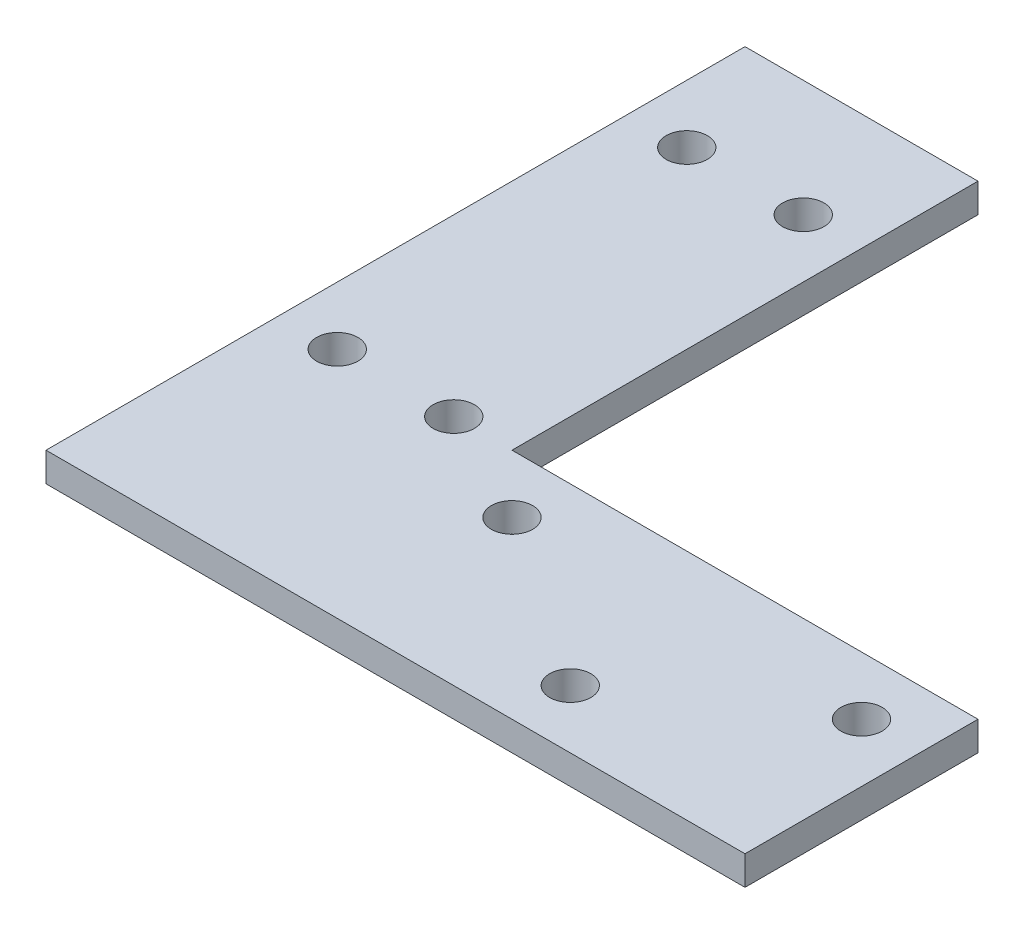
ISO-10303-21;
HEADER;
FILE_DESCRIPTION(('STEP AP214'),'2;1');
FILE_NAME('part.step','',(''),(''),'','','');
FILE_SCHEMA(('AUTOMOTIVE_DESIGN { 1 0 10303 214 1 1 1 1 }'));
ENDSEC;
DATA;
#1=APPLICATION_CONTEXT('core data for automotive mechanical design processes');
#2=APPLICATION_PROTOCOL_DEFINITION('international standard','automotive_design',2000,#1);
#3=PRODUCT_CONTEXT('',#1,'mechanical');
#4=PRODUCT('Part','Part','',(#3));
#5=PRODUCT_RELATED_PRODUCT_CATEGORY('part','',(#4));
#6=PRODUCT_DEFINITION_FORMATION('','',#4);
#7=PRODUCT_DEFINITION_CONTEXT('part definition',#1,'design');
#8=PRODUCT_DEFINITION('design','',#6,#7);
#9=PRODUCT_DEFINITION_SHAPE('','',#8);
#10=(LENGTH_UNIT() NAMED_UNIT(*) SI_UNIT(.MILLI.,.METRE.));
#11=(NAMED_UNIT(*) PLANE_ANGLE_UNIT() SI_UNIT($,.RADIAN.));
#12=(NAMED_UNIT(*) SI_UNIT($,.STERADIAN.) SOLID_ANGLE_UNIT());
#13=UNCERTAINTY_MEASURE_WITH_UNIT(LENGTH_MEASURE(1.E-05),#10,'distance_accuracy_value','');
#14=(GEOMETRIC_REPRESENTATION_CONTEXT(3) GLOBAL_UNCERTAINTY_ASSIGNED_CONTEXT((#13)) GLOBAL_UNIT_ASSIGNED_CONTEXT((#10,
#11,#12)) REPRESENTATION_CONTEXT('',''));
#15=CARTESIAN_POINT('',(0.,0.,0.));
#16=DIRECTION('',(0.,0.,1.));
#17=DIRECTION('',(1.,0.,0.));
#18=AXIS2_PLACEMENT_3D('',#15,#16,#17);
#19=CARTESIAN_POINT('',(0.,3.175,0.));
#20=DIRECTION('',(0.,1.,0.));
#21=DIRECTION('',(0.,0.,1.));
#22=AXIS2_PLACEMENT_3D('',#19,#20,#21);
#23=PLANE('',#22);
#24=CARTESIAN_POINT('',(6.35,3.175,-25.4));
#25=DIRECTION('',(0.,1.,0.));
#26=DIRECTION('',(0.,0.,1.));
#27=AXIS2_PLACEMENT_3D('',#24,#25,#26);
#28=CIRCLE('',#27,2.25);
#29=CARTESIAN_POINT('',(6.35,3.175,-23.15));
#30=VERTEX_POINT('',#29);
#31=EDGE_CURVE('E228',#30,#30,#28,.T.);
#32=ORIENTED_EDGE('',*,*,#31,.F.);
#33=EDGE_LOOP('',(#32));
#34=FACE_BOUND('',#33,.T.);
#35=CARTESIAN_POINT('',(19.05,3.175,-63.5));
#36=DIRECTION('',(0.,1.,0.));
#37=DIRECTION('',(0.,0.,1.));
#38=AXIS2_PLACEMENT_3D('',#35,#36,#37);
#39=CIRCLE('',#38,2.25);
#40=CARTESIAN_POINT('',(19.05,3.175,-61.25));
#41=VERTEX_POINT('',#40);
#42=EDGE_CURVE('E244',#41,#41,#39,.T.);
#43=ORIENTED_EDGE('',*,*,#42,.F.);
#44=EDGE_LOOP('',(#43));
#45=FACE_BOUND('',#44,.T.);
#46=CARTESIAN_POINT('',(69.85,3.175,-19.05));
#47=DIRECTION('',(0.,1.,0.));
#48=DIRECTION('',(0.,0.,1.));
#49=AXIS2_PLACEMENT_3D('',#46,#47,#48);
#50=CIRCLE('',#49,2.25);
#51=CARTESIAN_POINT('',(69.85,3.175,-16.8));
#52=VERTEX_POINT('',#51);
#53=EDGE_CURVE('E260',#52,#52,#50,.T.);
#54=ORIENTED_EDGE('',*,*,#53,.F.);
#55=EDGE_LOOP('',(#54));
#56=FACE_BOUND('',#55,.T.);
#57=DIRECTION('',(0.,0.,1.));
#58=VECTOR('',#57,1.);
#59=CARTESIAN_POINT('',(0.,3.175,-76.2));
#60=LINE('',#59,#58);
#61=CARTESIAN_POINT('',(0.,3.175,-76.2));
#62=VERTEX_POINT('',#61);
#63=CARTESIAN_POINT('',(0.,3.175,0.));
#64=VERTEX_POINT('',#63);
#65=EDGE_CURVE('E150',#62,#64,#60,.T.);
#66=ORIENTED_EDGE('',*,*,#65,.T.);
#67=DIRECTION('',(1.,0.,0.));
#68=VECTOR('',#67,1.);
#69=CARTESIAN_POINT('',(0.,3.175,0.));
#70=LINE('',#69,#68);
#71=CARTESIAN_POINT('',(76.2,3.175,0.));
#72=VERTEX_POINT('',#71);
#73=EDGE_CURVE('E98',#64,#72,#70,.T.);
#74=ORIENTED_EDGE('',*,*,#73,.T.);
#75=DIRECTION('',(0.,0.,-1.));
#76=VECTOR('',#75,1.);
#77=CARTESIAN_POINT('',(76.2,3.175,0.));
#78=LINE('',#77,#76);
#79=CARTESIAN_POINT('',(76.2,3.175,-25.4));
#80=VERTEX_POINT('',#79);
#81=EDGE_CURVE('E111',#72,#80,#78,.T.);
#82=ORIENTED_EDGE('',*,*,#81,.T.);
#83=DIRECTION('',(-1.,0.,0.));
#84=VECTOR('',#83,1.);
#85=CARTESIAN_POINT('',(76.2,3.175,-25.4));
#86=LINE('',#85,#84);
#87=CARTESIAN_POINT('',(25.4,3.175,-25.4));
#88=VERTEX_POINT('',#87);
#89=EDGE_CURVE('E105',#80,#88,#86,.T.);
#90=ORIENTED_EDGE('',*,*,#89,.T.);
#91=DIRECTION('',(0.,0.,-1.));
#92=VECTOR('',#91,1.);
#93=CARTESIAN_POINT('',(25.4,3.175,-25.4));
#94=LINE('',#93,#92);
#95=CARTESIAN_POINT('',(25.4,3.175,-76.2));
#96=VERTEX_POINT('',#95);
#97=EDGE_CURVE('E109',#88,#96,#94,.T.);
#98=ORIENTED_EDGE('',*,*,#97,.T.);
#99=DIRECTION('',(-1.,0.,0.));
#100=VECTOR('',#99,1.);
#101=CARTESIAN_POINT('',(25.4,3.175,-76.2));
#102=LINE('',#101,#100);
#103=EDGE_CURVE('E61',#96,#62,#102,.T.);
#104=ORIENTED_EDGE('',*,*,#103,.T.);
#105=EDGE_LOOP('',(#66,#74,#82,#90,#98,#104));
#106=FACE_BOUND('',#105,.T.);
#107=CARTESIAN_POINT('',(31.75,3.175,-19.05));
#108=DIRECTION('',(0.,1.,0.));
#109=DIRECTION('',(0.,0.,1.));
#110=AXIS2_PLACEMENT_3D('',#107,#108,#109);
#111=CIRCLE('',#110,2.25);
#112=CARTESIAN_POINT('',(31.75,3.175,-16.8));
#113=VERTEX_POINT('',#112);
#114=EDGE_CURVE('E138',#113,#113,#111,.T.);
#115=ORIENTED_EDGE('',*,*,#114,.F.);
#116=EDGE_LOOP('',(#115));
#117=FACE_BOUND('',#116,.T.);
#118=CARTESIAN_POINT('',(50.8,3.175,-6.35));
#119=DIRECTION('',(0.,1.,0.));
#120=DIRECTION('',(0.,0.,1.));
#121=AXIS2_PLACEMENT_3D('',#118,#119,#120);
#122=CIRCLE('',#121,2.25);
#123=CARTESIAN_POINT('',(50.8,3.175,-4.1));
#124=VERTEX_POINT('',#123);
#125=EDGE_CURVE('E252',#124,#124,#122,.T.);
#126=ORIENTED_EDGE('',*,*,#125,.F.);
#127=EDGE_LOOP('',(#126));
#128=FACE_BOUND('',#127,.T.);
#129=CARTESIAN_POINT('',(19.05,3.175,-25.4));
#130=DIRECTION('',(0.,1.,0.));
#131=DIRECTION('',(0.,0.,1.));
#132=AXIS2_PLACEMENT_3D('',#129,#130,#131);
#133=CIRCLE('',#132,2.25);
#134=CARTESIAN_POINT('',(19.05,3.175,-23.15));
#135=VERTEX_POINT('',#134);
#136=EDGE_CURVE('E236',#135,#135,#133,.T.);
#137=ORIENTED_EDGE('',*,*,#136,.F.);
#138=EDGE_LOOP('',(#137));
#139=FACE_BOUND('',#138,.T.);
#140=CARTESIAN_POINT('',(6.35,3.175,-63.5));
#141=DIRECTION('',(0.,1.,0.));
#142=DIRECTION('',(0.,0.,1.));
#143=AXIS2_PLACEMENT_3D('',#140,#141,#142);
#144=CIRCLE('',#143,2.25000000000001);
#145=CARTESIAN_POINT('',(6.35,3.175,-61.25));
#146=VERTEX_POINT('',#145);
#147=EDGE_CURVE('E217',#146,#146,#144,.T.);
#148=ORIENTED_EDGE('',*,*,#147,.F.);
#149=EDGE_LOOP('',(#148));
#150=FACE_BOUND('',#149,.T.);
#151=ADVANCED_FACE('F43',(#34,#45,#56,#106,#117,#128,#139,#150),#23,.T.);
#152=CARTESIAN_POINT('',(0.,0.,0.));
#153=DIRECTION('',(0.,1.,0.));
#154=DIRECTION('',(0.,0.,1.));
#155=AXIS2_PLACEMENT_3D('',#152,#153,#154);
#156=PLANE('',#155);
#157=DIRECTION('',(0.,0.,1.));
#158=VECTOR('',#157,1.);
#159=CARTESIAN_POINT('',(0.,0.,-76.2));
#160=LINE('',#159,#158);
#161=CARTESIAN_POINT('',(0.,0.,-76.2));
#162=VERTEX_POINT('',#161);
#163=CARTESIAN_POINT('',(0.,0.,0.));
#164=VERTEX_POINT('',#163);
#165=EDGE_CURVE('E133',#162,#164,#160,.T.);
#166=ORIENTED_EDGE('',*,*,#165,.F.);
#167=DIRECTION('',(-1.,0.,0.));
#168=VECTOR('',#167,1.);
#169=CARTESIAN_POINT('',(25.4,0.,-76.2));
#170=LINE('',#169,#168);
#171=CARTESIAN_POINT('',(25.4,0.,-76.2));
#172=VERTEX_POINT('',#171);
#173=EDGE_CURVE('E90',#172,#162,#170,.T.);
#174=ORIENTED_EDGE('',*,*,#173,.F.);
#175=DIRECTION('',(0.,0.,-1.));
#176=VECTOR('',#175,1.);
#177=CARTESIAN_POINT('',(25.4,0.,-25.4));
#178=LINE('',#177,#176);
#179=CARTESIAN_POINT('',(25.4,0.,-25.4));
#180=VERTEX_POINT('',#179);
#181=EDGE_CURVE('E84',#180,#172,#178,.T.);
#182=ORIENTED_EDGE('',*,*,#181,.F.);
#183=DIRECTION('',(-1.,0.,0.));
#184=VECTOR('',#183,1.);
#185=CARTESIAN_POINT('',(76.2,0.,-25.4));
#186=LINE('',#185,#184);
#187=CARTESIAN_POINT('',(76.2,0.,-25.4));
#188=VERTEX_POINT('',#187);
#189=EDGE_CURVE('E120',#188,#180,#186,.T.);
#190=ORIENTED_EDGE('',*,*,#189,.F.);
#191=DIRECTION('',(0.,0.,-1.));
#192=VECTOR('',#191,1.);
#193=CARTESIAN_POINT('',(76.2,0.,0.));
#194=LINE('',#193,#192);
#195=CARTESIAN_POINT('',(76.2,0.,0.));
#196=VERTEX_POINT('',#195);
#197=EDGE_CURVE('E141',#196,#188,#194,.T.);
#198=ORIENTED_EDGE('',*,*,#197,.F.);
#199=DIRECTION('',(1.,0.,0.));
#200=VECTOR('',#199,1.);
#201=CARTESIAN_POINT('',(0.,0.,0.));
#202=LINE('',#201,#200);
#203=EDGE_CURVE('E137',#164,#196,#202,.T.);
#204=ORIENTED_EDGE('',*,*,#203,.F.);
#205=EDGE_LOOP('',(#166,#174,#182,#190,#198,#204));
#206=FACE_BOUND('',#205,.T.);
#207=CARTESIAN_POINT('',(31.75,0.,-19.05));
#208=DIRECTION('',(0.,1.,0.));
#209=DIRECTION('',(0.,0.,1.));
#210=AXIS2_PLACEMENT_3D('',#207,#208,#209);
#211=CIRCLE('',#210,2.25);
#212=CARTESIAN_POINT('',(31.75,0.,-16.8));
#213=VERTEX_POINT('',#212);
#214=EDGE_CURVE('E264',#213,#213,#211,.T.);
#215=ORIENTED_EDGE('',*,*,#214,.T.);
#216=EDGE_LOOP('',(#215));
#217=FACE_BOUND('',#216,.T.);
#218=CARTESIAN_POINT('',(69.85,0.,-19.05));
#219=DIRECTION('',(0.,1.,0.));
#220=DIRECTION('',(0.,0.,1.));
#221=AXIS2_PLACEMENT_3D('',#218,#219,#220);
#222=CIRCLE('',#221,2.25);
#223=CARTESIAN_POINT('',(69.85,0.,-16.8));
#224=VERTEX_POINT('',#223);
#225=EDGE_CURVE('E256',#224,#224,#222,.T.);
#226=ORIENTED_EDGE('',*,*,#225,.T.);
#227=EDGE_LOOP('',(#226));
#228=FACE_BOUND('',#227,.T.);
#229=CARTESIAN_POINT('',(50.8,0.,-6.35));
#230=DIRECTION('',(0.,1.,0.));
#231=DIRECTION('',(0.,0.,1.));
#232=AXIS2_PLACEMENT_3D('',#229,#230,#231);
#233=CIRCLE('',#232,2.25);
#234=CARTESIAN_POINT('',(50.8,0.,-4.1));
#235=VERTEX_POINT('',#234);
#236=EDGE_CURVE('E248',#235,#235,#233,.T.);
#237=ORIENTED_EDGE('',*,*,#236,.T.);
#238=EDGE_LOOP('',(#237));
#239=FACE_BOUND('',#238,.T.);
#240=CARTESIAN_POINT('',(19.05,0.,-63.5));
#241=DIRECTION('',(0.,1.,0.));
#242=DIRECTION('',(0.,0.,1.));
#243=AXIS2_PLACEMENT_3D('',#240,#241,#242);
#244=CIRCLE('',#243,2.25);
#245=CARTESIAN_POINT('',(19.05,0.,-61.25));
#246=VERTEX_POINT('',#245);
#247=EDGE_CURVE('E240',#246,#246,#244,.T.);
#248=ORIENTED_EDGE('',*,*,#247,.T.);
#249=EDGE_LOOP('',(#248));
#250=FACE_BOUND('',#249,.T.);
#251=CARTESIAN_POINT('',(19.05,0.,-25.4));
#252=DIRECTION('',(0.,1.,0.));
#253=DIRECTION('',(0.,0.,1.));
#254=AXIS2_PLACEMENT_3D('',#251,#252,#253);
#255=CIRCLE('',#254,2.25);
#256=CARTESIAN_POINT('',(19.05,0.,-23.15));
#257=VERTEX_POINT('',#256);
#258=EDGE_CURVE('E232',#257,#257,#255,.T.);
#259=ORIENTED_EDGE('',*,*,#258,.T.);
#260=EDGE_LOOP('',(#259));
#261=FACE_BOUND('',#260,.T.);
#262=CARTESIAN_POINT('',(6.35,0.,-25.4));
#263=DIRECTION('',(0.,1.,0.));
#264=DIRECTION('',(0.,0.,1.));
#265=AXIS2_PLACEMENT_3D('',#262,#263,#264);
#266=CIRCLE('',#265,2.25);
#267=CARTESIAN_POINT('',(6.35,0.,-23.15));
#268=VERTEX_POINT('',#267);
#269=EDGE_CURVE('E225',#268,#268,#266,.T.);
#270=ORIENTED_EDGE('',*,*,#269,.T.);
#271=EDGE_LOOP('',(#270));
#272=FACE_BOUND('',#271,.T.);
#273=CARTESIAN_POINT('',(6.35,0.,-63.5));
#274=DIRECTION('',(0.,1.,0.));
#275=DIRECTION('',(0.,0.,1.));
#276=AXIS2_PLACEMENT_3D('',#273,#274,#275);
#277=CIRCLE('',#276,2.25000000000001);
#278=CARTESIAN_POINT('',(6.35,0.,-61.25));
#279=VERTEX_POINT('',#278);
#280=EDGE_CURVE('E220',#279,#279,#277,.T.);
#281=ORIENTED_EDGE('',*,*,#280,.T.);
#282=EDGE_LOOP('',(#281));
#283=FACE_BOUND('',#282,.T.);
#284=ADVANCED_FACE('F163',(#206,#217,#228,#239,#250,#261,#272,#283),#156,.F.);
#285=CARTESIAN_POINT('',(0.,3.175,-76.2));
#286=DIRECTION('',(1.,0.,0.));
#287=DIRECTION('',(0.,0.,-1.));
#288=AXIS2_PLACEMENT_3D('',#285,#286,#287);
#289=PLANE('',#288);
#290=ORIENTED_EDGE('',*,*,#165,.T.);
#291=DIRECTION('',(0.,-1.,0.));
#292=VECTOR('',#291,1.);
#293=CARTESIAN_POINT('',(0.,3.175,0.));
#294=LINE('',#293,#292);
#295=EDGE_CURVE('E11',#64,#164,#294,.T.);
#296=ORIENTED_EDGE('',*,*,#295,.F.);
#297=ORIENTED_EDGE('',*,*,#65,.F.);
#298=DIRECTION('',(0.,-1.,0.));
#299=VECTOR('',#298,1.);
#300=CARTESIAN_POINT('',(0.,3.175,-76.2));
#301=LINE('',#300,#299);
#302=EDGE_CURVE('E129',#62,#162,#301,.T.);
#303=ORIENTED_EDGE('',*,*,#302,.T.);
#304=EDGE_LOOP('',(#290,#296,#297,#303));
#305=FACE_BOUND('',#304,.T.);
#306=ADVANCED_FACE('F45',(#305),#289,.F.);
#307=CARTESIAN_POINT('',(0.,3.175,0.));
#308=DIRECTION('',(0.,0.,-1.));
#309=DIRECTION('',(-1.,0.,0.));
#310=AXIS2_PLACEMENT_3D('',#307,#308,#309);
#311=PLANE('',#310);
#312=ORIENTED_EDGE('',*,*,#203,.T.);
#313=DIRECTION('',(0.,-1.,0.));
#314=VECTOR('',#313,1.);
#315=CARTESIAN_POINT('',(76.2,3.175,0.));
#316=LINE('',#315,#314);
#317=EDGE_CURVE('E53',#72,#196,#316,.T.);
#318=ORIENTED_EDGE('',*,*,#317,.F.);
#319=ORIENTED_EDGE('',*,*,#73,.F.);
#320=ORIENTED_EDGE('',*,*,#295,.T.);
#321=EDGE_LOOP('',(#312,#318,#319,#320));
#322=FACE_BOUND('',#321,.T.);
#323=ADVANCED_FACE('F359',(#322),#311,.F.);
#324=CARTESIAN_POINT('',(76.2,3.175,0.));
#325=DIRECTION('',(-1.,0.,0.));
#326=DIRECTION('',(0.,0.,1.));
#327=AXIS2_PLACEMENT_3D('',#324,#325,#326);
#328=PLANE('',#327);
#329=ORIENTED_EDGE('',*,*,#197,.T.);
#330=DIRECTION('',(0.,-1.,0.));
#331=VECTOR('',#330,1.);
#332=CARTESIAN_POINT('',(76.2,3.175,-25.4));
#333=LINE('',#332,#331);
#334=EDGE_CURVE('E122',#80,#188,#333,.T.);
#335=ORIENTED_EDGE('',*,*,#334,.F.);
#336=ORIENTED_EDGE('',*,*,#81,.F.);
#337=ORIENTED_EDGE('',*,*,#317,.T.);
#338=EDGE_LOOP('',(#329,#335,#336,#337));
#339=FACE_BOUND('',#338,.T.);
#340=ADVANCED_FACE('F160',(#339),#328,.F.);
#341=CARTESIAN_POINT('',(76.2,3.175,-25.4));
#342=DIRECTION('',(0.,0.,1.));
#343=DIRECTION('',(1.,0.,0.));
#344=AXIS2_PLACEMENT_3D('',#341,#342,#343);
#345=PLANE('',#344);
#346=ORIENTED_EDGE('',*,*,#189,.T.);
#347=DIRECTION('',(0.,-1.,0.));
#348=VECTOR('',#347,1.);
#349=CARTESIAN_POINT('',(25.4,3.175,-25.4));
#350=LINE('',#349,#348);
#351=EDGE_CURVE('E117',#88,#180,#350,.T.);
#352=ORIENTED_EDGE('',*,*,#351,.F.);
#353=ORIENTED_EDGE('',*,*,#89,.F.);
#354=ORIENTED_EDGE('',*,*,#334,.T.);
#355=EDGE_LOOP('',(#346,#352,#353,#354));
#356=FACE_BOUND('',#355,.T.);
#357=ADVANCED_FACE('F118',(#356),#345,.F.);
#358=CARTESIAN_POINT('',(25.4,3.175,-25.4));
#359=DIRECTION('',(-1.,0.,0.));
#360=DIRECTION('',(0.,0.,1.));
#361=AXIS2_PLACEMENT_3D('',#358,#359,#360);
#362=PLANE('',#361);
#363=ORIENTED_EDGE('',*,*,#181,.T.);
#364=DIRECTION('',(0.,-1.,0.));
#365=VECTOR('',#364,1.);
#366=CARTESIAN_POINT('',(25.4,3.175,-76.2));
#367=LINE('',#366,#365);
#368=EDGE_CURVE('E123',#96,#172,#367,.T.);
#369=ORIENTED_EDGE('',*,*,#368,.F.);
#370=ORIENTED_EDGE('',*,*,#97,.F.);
#371=ORIENTED_EDGE('',*,*,#351,.T.);
#372=EDGE_LOOP('',(#363,#369,#370,#371));
#373=FACE_BOUND('',#372,.T.);
#374=ADVANCED_FACE('F125',(#373),#362,.F.);
#375=CARTESIAN_POINT('',(25.4,3.175,-76.2));
#376=DIRECTION('',(0.,0.,1.));
#377=DIRECTION('',(1.,0.,0.));
#378=AXIS2_PLACEMENT_3D('',#375,#376,#377);
#379=PLANE('',#378);
#380=ORIENTED_EDGE('',*,*,#173,.T.);
#381=ORIENTED_EDGE('',*,*,#302,.F.);
#382=ORIENTED_EDGE('',*,*,#103,.F.);
#383=ORIENTED_EDGE('',*,*,#368,.T.);
#384=EDGE_LOOP('',(#380,#381,#382,#383));
#385=FACE_BOUND('',#384,.T.);
#386=ADVANCED_FACE('F168',(#385),#379,.F.);
#387=CARTESIAN_POINT('',(31.75,3.175,-19.05));
#388=DIRECTION('',(0.,-1.,0.));
#389=DIRECTION('',(0.,0.,-1.));
#390=AXIS2_PLACEMENT_3D('',#387,#388,#389);
#391=CYLINDRICAL_SURFACE('',#390,2.25);
#392=ORIENTED_EDGE('',*,*,#114,.T.);
#393=EDGE_LOOP('',(#392));
#394=FACE_BOUND('',#393,.T.);
#395=ORIENTED_EDGE('',*,*,#214,.F.);
#396=EDGE_LOOP('',(#395));
#397=FACE_BOUND('',#396,.T.);
#398=ADVANCED_FACE('F170',(#394,#397),#391,.F.);
#399=CARTESIAN_POINT('',(69.85,3.175,-19.05));
#400=DIRECTION('',(0.,-1.,0.));
#401=DIRECTION('',(0.,0.,-1.));
#402=AXIS2_PLACEMENT_3D('',#399,#400,#401);
#403=CYLINDRICAL_SURFACE('',#402,2.25);
#404=ORIENTED_EDGE('',*,*,#53,.T.);
#405=EDGE_LOOP('',(#404));
#406=FACE_BOUND('',#405,.T.);
#407=ORIENTED_EDGE('',*,*,#225,.F.);
#408=EDGE_LOOP('',(#407));
#409=FACE_BOUND('',#408,.T.);
#410=ADVANCED_FACE('F176',(#406,#409),#403,.F.);
#411=CARTESIAN_POINT('',(50.8,3.175,-6.35));
#412=DIRECTION('',(0.,-1.,0.));
#413=DIRECTION('',(0.,0.,-1.));
#414=AXIS2_PLACEMENT_3D('',#411,#412,#413);
#415=CYLINDRICAL_SURFACE('',#414,2.25);
#416=ORIENTED_EDGE('',*,*,#125,.T.);
#417=EDGE_LOOP('',(#416));
#418=FACE_BOUND('',#417,.T.);
#419=ORIENTED_EDGE('',*,*,#236,.F.);
#420=EDGE_LOOP('',(#419));
#421=FACE_BOUND('',#420,.T.);
#422=ADVANCED_FACE('F192',(#418,#421),#415,.F.);
#423=CARTESIAN_POINT('',(19.05,3.175,-63.5));
#424=DIRECTION('',(0.,-1.,0.));
#425=DIRECTION('',(0.,0.,-1.));
#426=AXIS2_PLACEMENT_3D('',#423,#424,#425);
#427=CYLINDRICAL_SURFACE('',#426,2.25);
#428=ORIENTED_EDGE('',*,*,#42,.T.);
#429=EDGE_LOOP('',(#428));
#430=FACE_BOUND('',#429,.T.);
#431=ORIENTED_EDGE('',*,*,#247,.F.);
#432=EDGE_LOOP('',(#431));
#433=FACE_BOUND('',#432,.T.);
#434=ADVANCED_FACE('F196',(#430,#433),#427,.F.);
#435=CARTESIAN_POINT('',(19.05,3.175,-25.4));
#436=DIRECTION('',(0.,-1.,0.));
#437=DIRECTION('',(0.,0.,-1.));
#438=AXIS2_PLACEMENT_3D('',#435,#436,#437);
#439=CYLINDRICAL_SURFACE('',#438,2.25);
#440=ORIENTED_EDGE('',*,*,#136,.T.);
#441=EDGE_LOOP('',(#440));
#442=FACE_BOUND('',#441,.T.);
#443=ORIENTED_EDGE('',*,*,#258,.F.);
#444=EDGE_LOOP('',(#443));
#445=FACE_BOUND('',#444,.T.);
#446=ADVANCED_FACE('F200',(#442,#445),#439,.F.);
#447=CARTESIAN_POINT('',(6.35,3.175,-25.4));
#448=DIRECTION('',(0.,-1.,0.));
#449=DIRECTION('',(0.,0.,-1.));
#450=AXIS2_PLACEMENT_3D('',#447,#448,#449);
#451=CYLINDRICAL_SURFACE('',#450,2.25);
#452=ORIENTED_EDGE('',*,*,#31,.T.);
#453=EDGE_LOOP('',(#452));
#454=FACE_BOUND('',#453,.T.);
#455=ORIENTED_EDGE('',*,*,#269,.F.);
#456=EDGE_LOOP('',(#455));
#457=FACE_BOUND('',#456,.T.);
#458=ADVANCED_FACE('F204',(#454,#457),#451,.F.);
#459=CARTESIAN_POINT('',(6.35,3.175,-63.5));
#460=DIRECTION('',(0.,-1.,0.));
#461=DIRECTION('',(0.,0.,-1.));
#462=AXIS2_PLACEMENT_3D('',#459,#460,#461);
#463=CYLINDRICAL_SURFACE('',#462,2.25000000000001);
#464=ORIENTED_EDGE('',*,*,#147,.T.);
#465=EDGE_LOOP('',(#464));
#466=FACE_BOUND('',#465,.T.);
#467=ORIENTED_EDGE('',*,*,#280,.F.);
#468=EDGE_LOOP('',(#467));
#469=FACE_BOUND('',#468,.T.);
#470=ADVANCED_FACE('F208',(#466,#469),#463,.F.);
#471=CLOSED_SHELL('',(#151,#284,#306,#323,#340,#357,#374,#386,#398,#410,#422,#434,#446,#458,#470));
#472=MANIFOLD_SOLID_BREP('B2',#471);
#473=ADVANCED_BREP_SHAPE_REPRESENTATION('',(#18,#472),#14);
#474=SHAPE_DEFINITION_REPRESENTATION(#9,#473);
ENDSEC;
END-ISO-10303-21;
